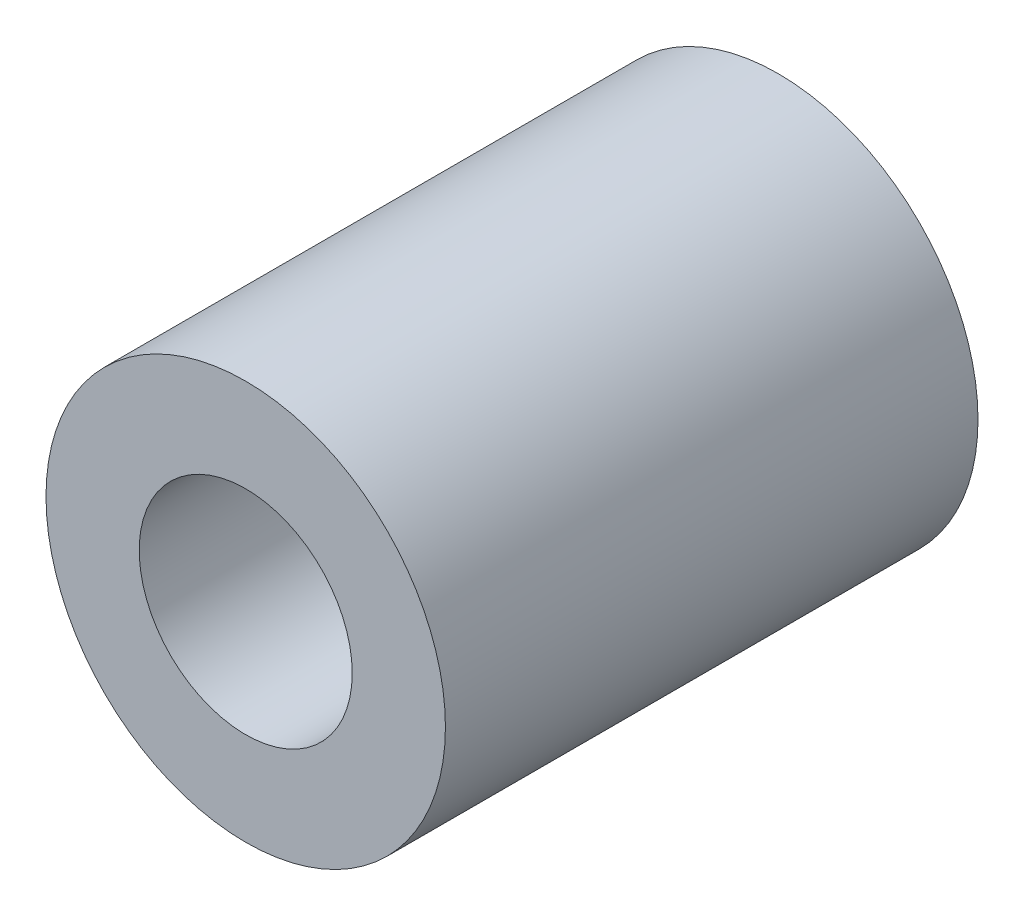
ISO-10303-21;
HEADER;
FILE_DESCRIPTION(('STEP AP214'),'2;1');
FILE_NAME('part.step','',(''),(''),'','','');
FILE_SCHEMA(('AUTOMOTIVE_DESIGN { 1 0 10303 214 1 1 1 1 }'));
ENDSEC;
DATA;
#1=APPLICATION_CONTEXT('core data for automotive mechanical design processes');
#2=APPLICATION_PROTOCOL_DEFINITION('international standard','automotive_design',2000,#1);
#3=PRODUCT_CONTEXT('',#1,'mechanical');
#4=PRODUCT('Part','Part','',(#3));
#5=PRODUCT_RELATED_PRODUCT_CATEGORY('part','',(#4));
#6=PRODUCT_DEFINITION_FORMATION('','',#4);
#7=PRODUCT_DEFINITION_CONTEXT('part definition',#1,'design');
#8=PRODUCT_DEFINITION('design','',#6,#7);
#9=PRODUCT_DEFINITION_SHAPE('','',#8);
#10=(LENGTH_UNIT() NAMED_UNIT(*) SI_UNIT(.MILLI.,.METRE.));
#11=(NAMED_UNIT(*) PLANE_ANGLE_UNIT() SI_UNIT($,.RADIAN.));
#12=(NAMED_UNIT(*) SI_UNIT($,.STERADIAN.) SOLID_ANGLE_UNIT());
#13=UNCERTAINTY_MEASURE_WITH_UNIT(LENGTH_MEASURE(1.E-05),#10,'distance_accuracy_value','');
#14=(GEOMETRIC_REPRESENTATION_CONTEXT(3) GLOBAL_UNCERTAINTY_ASSIGNED_CONTEXT((#13)) GLOBAL_UNIT_ASSIGNED_CONTEXT((#10,
#11,#12)) REPRESENTATION_CONTEXT('',''));
#15=CARTESIAN_POINT('',(0.,0.,0.));
#16=DIRECTION('',(0.,0.,1.));
#17=DIRECTION('',(1.,0.,0.));
#18=AXIS2_PLACEMENT_3D('',#15,#16,#17);
#19=CARTESIAN_POINT('',(0.,0.,8.));
#20=DIRECTION('',(0.,0.,1.));
#21=DIRECTION('',(1.,0.,0.));
#22=AXIS2_PLACEMENT_3D('',#19,#20,#21);
#23=PLANE('',#22);
#24=CARTESIAN_POINT('',(0.,0.,8.));
#25=DIRECTION('',(0.,0.,1.));
#26=DIRECTION('',(1.,0.,0.));
#27=AXIS2_PLACEMENT_3D('',#24,#25,#26);
#28=CIRCLE('',#27,3.);
#29=CARTESIAN_POINT('',(3.,0.,8.));
#30=VERTEX_POINT('',#29);
#31=EDGE_CURVE('E10',#30,#30,#28,.T.);
#32=ORIENTED_EDGE('',*,*,#31,.T.);
#33=EDGE_LOOP('',(#32));
#34=FACE_BOUND('',#33,.T.);
#35=CARTESIAN_POINT('',(0.,0.,8.));
#36=DIRECTION('',(0.,0.,1.));
#37=DIRECTION('',(1.,0.,0.));
#38=AXIS2_PLACEMENT_3D('',#35,#36,#37);
#39=CIRCLE('',#38,1.6);
#40=CARTESIAN_POINT('',(1.6,0.,8.));
#41=VERTEX_POINT('',#40);
#42=EDGE_CURVE('E43',#41,#41,#39,.T.);
#43=ORIENTED_EDGE('',*,*,#42,.F.);
#44=EDGE_LOOP('',(#43));
#45=FACE_BOUND('',#44,.T.);
#46=ADVANCED_FACE('F32',(#34,#45),#23,.T.);
#47=CARTESIAN_POINT('',(0.,0.,0.));
#48=DIRECTION('',(0.,0.,1.));
#49=DIRECTION('',(1.,0.,0.));
#50=AXIS2_PLACEMENT_3D('',#47,#48,#49);
#51=PLANE('',#50);
#52=CARTESIAN_POINT('',(0.,0.,0.));
#53=DIRECTION('',(0.,0.,1.));
#54=DIRECTION('',(1.,0.,0.));
#55=AXIS2_PLACEMENT_3D('',#52,#53,#54);
#56=CIRCLE('',#55,3.);
#57=CARTESIAN_POINT('',(3.,0.,0.));
#58=VERTEX_POINT('',#57);
#59=EDGE_CURVE('E36',#58,#58,#56,.T.);
#60=ORIENTED_EDGE('',*,*,#59,.F.);
#61=EDGE_LOOP('',(#60));
#62=FACE_BOUND('',#61,.T.);
#63=CARTESIAN_POINT('',(0.,0.,0.));
#64=DIRECTION('',(0.,0.,1.));
#65=DIRECTION('',(1.,0.,0.));
#66=AXIS2_PLACEMENT_3D('',#63,#64,#65);
#67=CIRCLE('',#66,1.6);
#68=CARTESIAN_POINT('',(1.6,0.,0.));
#69=VERTEX_POINT('',#68);
#70=EDGE_CURVE('E45',#69,#69,#67,.T.);
#71=ORIENTED_EDGE('',*,*,#70,.T.);
#72=EDGE_LOOP('',(#71));
#73=FACE_BOUND('',#72,.T.);
#74=ADVANCED_FACE('F55',(#62,#73),#51,.F.);
#75=CARTESIAN_POINT('',(0.,0.,8.));
#76=DIRECTION('',(0.,0.,-1.));
#77=DIRECTION('',(-1.,0.,0.));
#78=AXIS2_PLACEMENT_3D('',#75,#76,#77);
#79=CYLINDRICAL_SURFACE('',#78,3.);
#80=ORIENTED_EDGE('',*,*,#31,.F.);
#81=EDGE_LOOP('',(#80));
#82=FACE_BOUND('',#81,.T.);
#83=ORIENTED_EDGE('',*,*,#59,.T.);
#84=EDGE_LOOP('',(#83));
#85=FACE_BOUND('',#84,.T.);
#86=ADVANCED_FACE('F34',(#82,#85),#79,.T.);
#87=CARTESIAN_POINT('',(0.,0.,8.));
#88=DIRECTION('',(0.,0.,-1.));
#89=DIRECTION('',(-1.,0.,0.));
#90=AXIS2_PLACEMENT_3D('',#87,#88,#89);
#91=CYLINDRICAL_SURFACE('',#90,1.6);
#92=ORIENTED_EDGE('',*,*,#42,.T.);
#93=EDGE_LOOP('',(#92));
#94=FACE_BOUND('',#93,.T.);
#95=ORIENTED_EDGE('',*,*,#70,.F.);
#96=EDGE_LOOP('',(#95));
#97=FACE_BOUND('',#96,.T.);
#98=ADVANCED_FACE('F51',(#94,#97),#91,.F.);
#99=CLOSED_SHELL('',(#46,#74,#86,#98));
#100=MANIFOLD_SOLID_BREP('B2',#99);
#101=ADVANCED_BREP_SHAPE_REPRESENTATION('',(#18,#100),#14);
#102=SHAPE_DEFINITION_REPRESENTATION(#9,#101);
ENDSEC;
END-ISO-10303-21;
